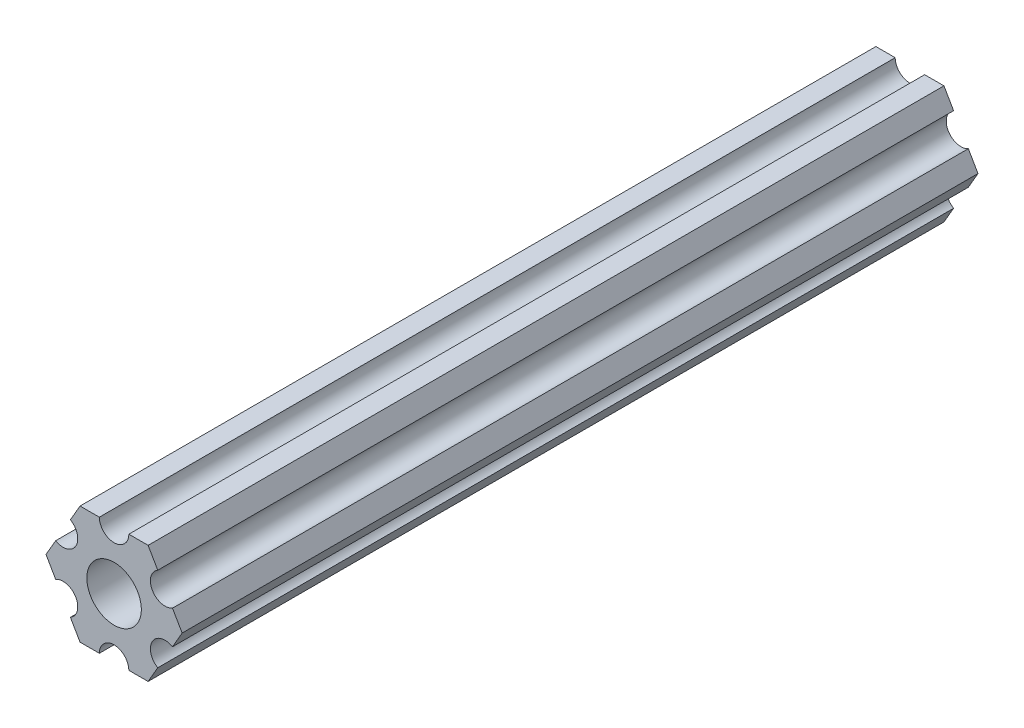
ISO-10303-21;
HEADER;
FILE_DESCRIPTION(('STEP AP214'),'2;1');
FILE_NAME('part.step','',(''),(''),'','','');
FILE_SCHEMA(('AUTOMOTIVE_DESIGN { 1 0 10303 214 1 1 1 1 }'));
ENDSEC;
DATA;
#1=APPLICATION_CONTEXT('core data for automotive mechanical design processes');
#2=APPLICATION_PROTOCOL_DEFINITION('international standard','automotive_design',2000,#1);
#3=PRODUCT_CONTEXT('',#1,'mechanical');
#4=PRODUCT('Part','Part','',(#3));
#5=PRODUCT_RELATED_PRODUCT_CATEGORY('part','',(#4));
#6=PRODUCT_DEFINITION_FORMATION('','',#4);
#7=PRODUCT_DEFINITION_CONTEXT('part definition',#1,'design');
#8=PRODUCT_DEFINITION('design','',#6,#7);
#9=PRODUCT_DEFINITION_SHAPE('','',#8);
#10=(LENGTH_UNIT() NAMED_UNIT(*) SI_UNIT(.MILLI.,.METRE.));
#11=(NAMED_UNIT(*) PLANE_ANGLE_UNIT() SI_UNIT($,.RADIAN.));
#12=(NAMED_UNIT(*) SI_UNIT($,.STERADIAN.) SOLID_ANGLE_UNIT());
#13=UNCERTAINTY_MEASURE_WITH_UNIT(LENGTH_MEASURE(1.E-05),#10,'distance_accuracy_value','');
#14=(GEOMETRIC_REPRESENTATION_CONTEXT(3) GLOBAL_UNCERTAINTY_ASSIGNED_CONTEXT((#13)) GLOBAL_UNIT_ASSIGNED_CONTEXT((#10,
#11,#12)) REPRESENTATION_CONTEXT('',''));
#15=CARTESIAN_POINT('',(0.,0.,0.));
#16=DIRECTION('',(0.,0.,1.));
#17=DIRECTION('',(1.,0.,0.));
#18=AXIS2_PLACEMENT_3D('',#15,#16,#17);
#19=CARTESIAN_POINT('',(6.29301142309098,-1.80018429024546,85.725));
#20=DIRECTION('',(-0.866025434075723,0.499999947533953,0.));
#21=DIRECTION('',(-0.499999947533953,-0.866025434075723,0.));
#22=AXIS2_PLACEMENT_3D('',#19,#20,#21);
#23=PLANE('',#22);
#24=DIRECTION('',(0.,0.,1.));
#25=VECTOR('',#24,1.);
#26=CARTESIAN_POINT('',(7.33234841870826,4.44212519169686E-07,85.725));
#27=LINE('',#26,#25);
#28=CARTESIAN_POINT('',(7.33234841870826,4.44212518961143E-07,0.));
#29=VERTEX_POINT('',#28);
#30=CARTESIAN_POINT('',(7.33234841870826,4.44212519315656E-07,85.725));
#31=VERTEX_POINT('',#30);
#32=EDGE_CURVE('E300',#29,#31,#27,.T.);
#33=ORIENTED_EDGE('',*,*,#32,.T.);
#34=DIRECTION('',(0.499999947533953,0.866025434075723,0.));
#35=VECTOR('',#34,1.);
#36=CARTESIAN_POINT('',(6.29301142309098,-1.80018429024546,85.725));
#37=LINE('',#36,#35);
#38=CARTESIAN_POINT('',(6.29301142309098,-1.80018429024546,85.725));
#39=VERTEX_POINT('',#38);
#40=EDGE_CURVE('E183',#39,#31,#37,.T.);
#41=ORIENTED_EDGE('',*,*,#40,.F.);
#42=DIRECTION('',(0.,0.,-1.));
#43=VECTOR('',#42,1.);
#44=CARTESIAN_POINT('',(6.29301142309098,-1.80018429024546,85.725));
#45=LINE('',#44,#43);
#46=CARTESIAN_POINT('',(6.29301142309098,-1.80018429024546,0.));
#47=VERTEX_POINT('',#46);
#48=EDGE_CURVE('E249',#39,#47,#45,.T.);
#49=ORIENTED_EDGE('',*,*,#48,.T.);
#50=DIRECTION('',(0.499999947533953,0.866025434075723,0.));
#51=VECTOR('',#50,1.);
#52=CARTESIAN_POINT('',(6.29301142309098,-1.80018429024546,0.));
#53=LINE('',#52,#51);
#54=EDGE_CURVE('E187',#47,#29,#53,.T.);
#55=ORIENTED_EDGE('',*,*,#54,.T.);
#56=EDGE_LOOP('',(#33,#41,#49,#55));
#57=FACE_BOUND('',#56,.T.);
#58=ADVANCED_FACE('F18',(#57),#23,.F.);
#59=CARTESIAN_POINT('',(7.33234841870826,4.44212519169686E-07,85.725));
#60=DIRECTION('',(-0.866025373493145,-0.500000052466056,0.));
#61=DIRECTION('',(0.500000052466056,-0.866025373493145,0.));
#62=AXIS2_PLACEMENT_3D('',#59,#60,#61);
#63=PLANE('',#62);
#64=DIRECTION('',(0.,0.,-1.));
#65=VECTOR('',#64,1.);
#66=CARTESIAN_POINT('',(6.29301120497139,1.80018505273895,85.725));
#67=LINE('',#66,#65);
#68=CARTESIAN_POINT('',(6.29301120497139,1.80018505273895,0.));
#69=VERTEX_POINT('',#68);
#70=CARTESIAN_POINT('',(6.29301120497139,1.80018505273895,85.725));
#71=VERTEX_POINT('',#70);
#72=EDGE_CURVE('E298',#69,#71,#67,.F.);
#73=ORIENTED_EDGE('',*,*,#72,.T.);
#74=DIRECTION('',(-0.500000052466056,0.866025373493145,0.));
#75=VECTOR('',#74,1.);
#76=CARTESIAN_POINT('',(7.33234841870826,4.44212519198905E-07,85.725));
#77=LINE('',#76,#75);
#78=EDGE_CURVE('E65',#31,#71,#77,.T.);
#79=ORIENTED_EDGE('',*,*,#78,.F.);
#80=ORIENTED_EDGE('',*,*,#32,.F.);
#81=DIRECTION('',(-0.500000052466056,0.866025373493145,0.));
#82=VECTOR('',#81,1.);
#83=CARTESIAN_POINT('',(7.33234841870826,4.44212519198905E-07,0.));
#84=LINE('',#83,#82);
#85=EDGE_CURVE('E246',#29,#69,#84,.T.);
#86=ORIENTED_EDGE('',*,*,#85,.T.);
#87=EDGE_LOOP('',(#73,#79,#80,#86));
#88=FACE_BOUND('',#87,.T.);
#89=ADVANCED_FACE('F347',(#88),#63,.F.);
#90=CARTESIAN_POINT('',(5.49926112168156,3.17500033315933,85.725));
#91=DIRECTION('',(0.,0.,-1.));
#92=DIRECTION('',(-1.,0.,0.));
#93=AXIS2_PLACEMENT_3D('',#90,#91,#92);
#94=CYLINDRICAL_SURFACE('',#93,1.5875);
#95=CARTESIAN_POINT('',(5.49926112168156,3.17500033315933,85.725));
#96=DIRECTION('',(0.,0.,-1.));
#97=DIRECTION('',(-1.,0.,0.));
#98=AXIS2_PLACEMENT_3D('',#95,#96,#97);
#99=CIRCLE('',#98,1.5875);
#100=CARTESIAN_POINT('',(4.70551103839172,4.54981561357972,85.725));
#101=VERTEX_POINT('',#100);
#102=EDGE_CURVE('E57',#71,#101,#99,.T.);
#103=ORIENTED_EDGE('',*,*,#102,.F.);
#104=ORIENTED_EDGE('',*,*,#72,.F.);
#105=CARTESIAN_POINT('',(5.49926112168156,3.17500033315933,0.));
#106=DIRECTION('',(0.,0.,-1.));
#107=DIRECTION('',(-1.,0.,0.));
#108=AXIS2_PLACEMENT_3D('',#105,#106,#107);
#109=CIRCLE('',#108,1.5875);
#110=CARTESIAN_POINT('',(4.70551103839172,4.54981561357972,0.));
#111=VERTEX_POINT('',#110);
#112=EDGE_CURVE('E21',#69,#111,#109,.T.);
#113=ORIENTED_EDGE('',*,*,#112,.T.);
#114=DIRECTION('',(0.,0.,1.));
#115=VECTOR('',#114,1.);
#116=CARTESIAN_POINT('',(4.70551103839172,4.54981561357972,85.725));
#117=LINE('',#116,#115);
#118=EDGE_CURVE('E294',#111,#101,#117,.T.);
#119=ORIENTED_EDGE('',*,*,#118,.T.);
#120=EDGE_LOOP('',(#103,#104,#113,#119));
#121=FACE_BOUND('',#120,.T.);
#122=ADVANCED_FACE('F345',(#121),#94,.F.);
#123=CARTESIAN_POINT('',(4.70551103839172,4.54981561357972,85.725));
#124=DIRECTION('',(-0.866025373493151,-0.500000052466046,0.));
#125=DIRECTION('',(0.500000052466046,-0.866025373493151,0.));
#126=AXIS2_PLACEMENT_3D('',#123,#124,#125);
#127=PLANE('',#126);
#128=DIRECTION('',(0.,0.,1.));
#129=VECTOR('',#128,1.);
#130=CARTESIAN_POINT('',(3.66617382465481,6.35000022210627,85.725));
#131=LINE('',#130,#129);
#132=CARTESIAN_POINT('',(3.66617382465481,6.35000022210627,0.));
#133=VERTEX_POINT('',#132);
#134=CARTESIAN_POINT('',(3.66617382465481,6.35000022210627,85.725));
#135=VERTEX_POINT('',#134);
#136=EDGE_CURVE('E291',#133,#135,#131,.T.);
#137=ORIENTED_EDGE('',*,*,#136,.T.);
#138=DIRECTION('',(-0.500000052466046,0.866025373493151,0.));
#139=VECTOR('',#138,1.);
#140=CARTESIAN_POINT('',(4.70551103839172,4.54981561357972,85.725));
#141=LINE('',#140,#139);
#142=EDGE_CURVE('E176',#101,#135,#141,.T.);
#143=ORIENTED_EDGE('',*,*,#142,.F.);
#144=ORIENTED_EDGE('',*,*,#118,.F.);
#145=DIRECTION('',(-0.500000052466046,0.866025373493151,0.));
#146=VECTOR('',#145,1.);
#147=CARTESIAN_POINT('',(4.70551103839172,4.54981561357972,0.));
#148=LINE('',#147,#146);
#149=EDGE_CURVE('E239',#111,#133,#148,.T.);
#150=ORIENTED_EDGE('',*,*,#149,.T.);
#151=EDGE_LOOP('',(#137,#143,#144,#150));
#152=FACE_BOUND('',#151,.T.);
#153=ADVANCED_FACE('F338',(#152),#127,.F.);
#154=CARTESIAN_POINT('',(3.66617382465481,6.35000022210627,85.725));
#155=DIRECTION('',(6.05825850611185E-08,-0.999999999999998,0.));
#156=DIRECTION('',(0.999999999999998,6.05825850611185E-08,0.));
#157=AXIS2_PLACEMENT_3D('',#154,#155,#156);
#158=PLANE('',#157);
#159=DIRECTION('',(0.,0.,-1.));
#160=VECTOR('',#159,1.);
#161=CARTESIAN_POINT('',(1.58749961530074,6.35000009617482,85.725));
#162=LINE('',#161,#160);
#163=CARTESIAN_POINT('',(1.58749961530073,6.35000015914054,0.));
#164=VERTEX_POINT('',#163);
#165=CARTESIAN_POINT('',(1.58749961530073,6.35000015914054,85.725));
#166=VERTEX_POINT('',#165);
#167=EDGE_CURVE('E289',#164,#166,#162,.F.);
#168=ORIENTED_EDGE('',*,*,#167,.T.);
#169=DIRECTION('',(1.,0.,0.));
#170=VECTOR('',#169,1.);
#171=CARTESIAN_POINT('',(5.49926112168156,6.35000022210627,85.725));
#172=LINE('',#171,#170);
#173=EDGE_CURVE('E146',#135,#166,#172,.F.);
#174=ORIENTED_EDGE('',*,*,#173,.F.);
#175=ORIENTED_EDGE('',*,*,#136,.F.);
#176=DIRECTION('',(1.,0.,0.));
#177=VECTOR('',#176,1.);
#178=CARTESIAN_POINT('',(5.49926112168156,6.35000022210627,0.));
#179=LINE('',#178,#177);
#180=EDGE_CURVE('E236',#133,#164,#179,.F.);
#181=ORIENTED_EDGE('',*,*,#180,.T.);
#182=EDGE_LOOP('',(#168,#174,#175,#181));
#183=FACE_BOUND('',#182,.T.);
#184=ADVANCED_FACE('F335',(#183),#158,.F.);
#185=CARTESIAN_POINT('',(-3.84699260060323E-07,6.35,85.725));
#186=DIRECTION('',(0.,0.,-1.));
#187=DIRECTION('',(-1.,0.,0.));
#188=AXIS2_PLACEMENT_3D('',#185,#186,#187);
#189=CYLINDRICAL_SURFACE('',#188,1.5875);
#190=DIRECTION('',(0.,0.,1.));
#191=VECTOR('',#190,1.);
#192=CARTESIAN_POINT('',(-1.58750038469926,6.34999990382518,85.725));
#193=LINE('',#192,#191);
#194=CARTESIAN_POINT('',(-1.58750038469926,6.34999990382518,0.));
#195=VERTEX_POINT('',#194);
#196=CARTESIAN_POINT('',(-1.58750038469926,6.34999990382518,85.725));
#197=VERTEX_POINT('',#196);
#198=EDGE_CURVE('E105',#195,#197,#193,.T.);
#199=ORIENTED_EDGE('',*,*,#198,.T.);
#200=CARTESIAN_POINT('',(-3.84699260060323E-07,6.35,85.725));
#201=DIRECTION('',(0.,0.,-1.));
#202=DIRECTION('',(-1.,0.,0.));
#203=AXIS2_PLACEMENT_3D('',#200,#201,#202);
#204=CIRCLE('',#203,1.5875);
#205=EDGE_CURVE('E150',#166,#197,#204,.T.);
#206=ORIENTED_EDGE('',*,*,#205,.F.);
#207=ORIENTED_EDGE('',*,*,#167,.F.);
#208=CARTESIAN_POINT('',(-3.84699260060323E-07,6.35,0.));
#209=DIRECTION('',(0.,0.,-1.));
#210=DIRECTION('',(-1.,0.,0.));
#211=AXIS2_PLACEMENT_3D('',#208,#209,#210);
#212=CIRCLE('',#211,1.5875);
#213=EDGE_CURVE('E233',#164,#195,#212,.T.);
#214=ORIENTED_EDGE('',*,*,#213,.T.);
#215=EDGE_LOOP('',(#199,#206,#207,#214));
#216=FACE_BOUND('',#215,.T.);
#217=ADVANCED_FACE('F329',(#216),#189,.F.);
#218=CARTESIAN_POINT('',(-1.58750038469926,6.34999990382518,85.725));
#219=DIRECTION('',(6.05825963273174E-08,-0.999999999999998,0.));
#220=DIRECTION('',(0.999999999999998,6.05825963273174E-08,0.));
#221=AXIS2_PLACEMENT_3D('',#218,#219,#220);
#222=PLANE('',#221);
#223=DIRECTION('',(0.,0.,1.));
#224=VECTOR('',#223,1.);
#225=CARTESIAN_POINT('',(-3.66617459405349,6.3499997778937,85.725));
#226=LINE('',#225,#224);
#227=CARTESIAN_POINT('',(-3.66617454558244,6.34999986184803,0.));
#228=VERTEX_POINT('',#227);
#229=CARTESIAN_POINT('',(-3.66617454558244,6.34999986184803,85.725));
#230=VERTEX_POINT('',#229);
#231=EDGE_CURVE('E113',#228,#230,#226,.T.);
#232=ORIENTED_EDGE('',*,*,#231,.T.);
#233=DIRECTION('',(1.,0.,0.));
#234=VECTOR('',#233,1.);
#235=CARTESIAN_POINT('',(5.49926112168156,6.34999990382518,85.725));
#236=LINE('',#235,#234);
#237=EDGE_CURVE('E151',#197,#230,#236,.F.);
#238=ORIENTED_EDGE('',*,*,#237,.F.);
#239=ORIENTED_EDGE('',*,*,#198,.F.);
#240=DIRECTION('',(1.,0.,0.));
#241=VECTOR('',#240,1.);
#242=CARTESIAN_POINT('',(5.49926112168156,6.34999990382518,0.));
#243=LINE('',#242,#241);
#244=EDGE_CURVE('E158',#195,#228,#243,.F.);
#245=ORIENTED_EDGE('',*,*,#244,.T.);
#246=EDGE_LOOP('',(#232,#238,#239,#245));
#247=FACE_BOUND('',#246,.T.);
#248=ADVANCED_FACE('F157',(#247),#222,.F.);
#249=CARTESIAN_POINT('',(-3.66617459405349,6.3499997778937,85.725));
#250=DIRECTION('',(0.866025434075729,-0.499999947533942,0.));
#251=DIRECTION('',(0.499999947533942,0.866025434075729,0.));
#252=AXIS2_PLACEMENT_3D('',#249,#250,#251);
#253=PLANE('',#252);
#254=DIRECTION('',(0.,0.,-1.));
#255=VECTOR('',#254,1.);
#256=CARTESIAN_POINT('',(-4.70551158967065,4.54981504343587,85.725));
#257=LINE('',#256,#255);
#258=CARTESIAN_POINT('',(-4.70551158967065,4.54981504343587,0.));
#259=VERTEX_POINT('',#258);
#260=CARTESIAN_POINT('',(-4.70551158967065,4.54981504343587,85.725));
#261=VERTEX_POINT('',#260);
#262=EDGE_CURVE('E159',#259,#261,#257,.F.);
#263=ORIENTED_EDGE('',*,*,#262,.T.);
#264=DIRECTION('',(-0.499999947533943,-0.866025434075729,0.));
#265=VECTOR('',#264,1.);
#266=CARTESIAN_POINT('',(-3.66617459405349,6.3499997778937,85.725));
#267=LINE('',#266,#265);
#268=EDGE_CURVE('E154',#230,#261,#267,.T.);
#269=ORIENTED_EDGE('',*,*,#268,.F.);
#270=ORIENTED_EDGE('',*,*,#231,.F.);
#271=DIRECTION('',(-0.499999947533943,-0.866025434075729,0.));
#272=VECTOR('',#271,1.);
#273=CARTESIAN_POINT('',(-3.66617459405349,6.3499997778937,0.));
#274=LINE('',#273,#272);
#275=EDGE_CURVE('E228',#228,#259,#274,.T.);
#276=ORIENTED_EDGE('',*,*,#275,.T.);
#277=EDGE_LOOP('',(#263,#269,#270,#276));
#278=FACE_BOUND('',#277,.T.);
#279=ADVANCED_FACE('F161',(#278),#253,.F.);
#280=CARTESIAN_POINT('',(-5.49926150638082,3.17499966684067,85.725));
#281=DIRECTION('',(0.,0.,-1.));
#282=DIRECTION('',(-1.,0.,0.));
#283=AXIS2_PLACEMENT_3D('',#280,#281,#282);
#284=CYLINDRICAL_SURFACE('',#283,1.5875);
#285=DIRECTION('',(0.,0.,1.));
#286=VECTOR('',#285,1.);
#287=CARTESIAN_POINT('',(-6.29301142309098,1.80018429024547,85.725));
#288=LINE('',#287,#286);
#289=CARTESIAN_POINT('',(-6.29301142309098,1.80018429024547,0.));
#290=VERTEX_POINT('',#289);
#291=CARTESIAN_POINT('',(-6.29301142309098,1.80018429024547,85.725));
#292=VERTEX_POINT('',#291);
#293=EDGE_CURVE('E280',#290,#292,#288,.T.);
#294=ORIENTED_EDGE('',*,*,#293,.T.);
#295=CARTESIAN_POINT('',(-5.49926150638082,3.17499966684067,85.725));
#296=DIRECTION('',(0.,0.,-1.));
#297=DIRECTION('',(-1.,0.,0.));
#298=AXIS2_PLACEMENT_3D('',#295,#296,#297);
#299=CIRCLE('',#298,1.5875);
#300=EDGE_CURVE('E163',#261,#292,#299,.T.);
#301=ORIENTED_EDGE('',*,*,#300,.F.);
#302=ORIENTED_EDGE('',*,*,#262,.F.);
#303=CARTESIAN_POINT('',(-5.49926150638082,3.17499966684067,0.));
#304=DIRECTION('',(0.,0.,-1.));
#305=DIRECTION('',(-1.,0.,0.));
#306=AXIS2_PLACEMENT_3D('',#303,#304,#305);
#307=CIRCLE('',#306,1.5875);
#308=EDGE_CURVE('E225',#259,#290,#307,.T.);
#309=ORIENTED_EDGE('',*,*,#308,.T.);
#310=EDGE_LOOP('',(#294,#301,#302,#309));
#311=FACE_BOUND('',#310,.T.);
#312=ADVANCED_FACE('F410',(#311),#284,.F.);
#313=CARTESIAN_POINT('',(-6.29301142309098,1.80018429024547,85.725));
#314=DIRECTION('',(0.866025434075724,-0.499999947533951,0.));
#315=DIRECTION('',(0.499999947533951,0.866025434075724,0.));
#316=AXIS2_PLACEMENT_3D('',#313,#314,#315);
#317=PLANE('',#316);
#318=DIRECTION('',(0.,0.,1.));
#319=VECTOR('',#318,1.);
#320=CARTESIAN_POINT('',(-7.33234841870826,-4.44212523790841E-07,85.725));
#321=LINE('',#320,#319);
#322=CARTESIAN_POINT('',(-7.33234841870826,-4.44212524036367E-07,0.));
#323=VERTEX_POINT('',#322);
#324=CARTESIAN_POINT('',(-7.33234841870826,-4.44212524036367E-07,85.725));
#325=VERTEX_POINT('',#324);
#326=EDGE_CURVE('E277',#323,#325,#321,.T.);
#327=ORIENTED_EDGE('',*,*,#326,.T.);
#328=DIRECTION('',(-0.499999947533952,-0.866025434075724,0.));
#329=VECTOR('',#328,1.);
#330=CARTESIAN_POINT('',(-6.29301142309098,1.80018429024547,85.725));
#331=LINE('',#330,#329);
#332=EDGE_CURVE('E165',#292,#325,#331,.T.);
#333=ORIENTED_EDGE('',*,*,#332,.F.);
#334=ORIENTED_EDGE('',*,*,#293,.F.);
#335=DIRECTION('',(-0.499999947533952,-0.866025434075724,0.));
#336=VECTOR('',#335,1.);
#337=CARTESIAN_POINT('',(-6.29301142309098,1.80018429024547,0.));
#338=LINE('',#337,#336);
#339=EDGE_CURVE('E220',#290,#323,#338,.T.);
#340=ORIENTED_EDGE('',*,*,#339,.T.);
#341=EDGE_LOOP('',(#327,#333,#334,#340));
#342=FACE_BOUND('',#341,.T.);
#343=ADVANCED_FACE('F378',(#342),#317,.F.);
#344=CARTESIAN_POINT('',(-7.33234841870826,-4.44212523790841E-07,85.725));
#345=DIRECTION('',(0.866025373493151,0.500000052466045,0.));
#346=DIRECTION('',(-0.500000052466045,0.866025373493151,0.));
#347=AXIS2_PLACEMENT_3D('',#344,#345,#346);
#348=PLANE('',#347);
#349=DIRECTION('',(0.,0.,-1.));
#350=VECTOR('',#349,1.);
#351=CARTESIAN_POINT('',(-6.29301120497141,-1.80018505273896,85.725));
#352=LINE('',#351,#350);
#353=CARTESIAN_POINT('',(-6.29301120497141,-1.80018505273896,0.));
#354=VERTEX_POINT('',#353);
#355=CARTESIAN_POINT('',(-6.29301120497141,-1.80018505273896,85.725));
#356=VERTEX_POINT('',#355);
#357=EDGE_CURVE('E274',#354,#356,#352,.F.);
#358=ORIENTED_EDGE('',*,*,#357,.T.);
#359=DIRECTION('',(0.500000052466045,-0.866025373493151,0.));
#360=VECTOR('',#359,1.);
#361=CARTESIAN_POINT('',(-7.33234841870826,-4.44212523969395E-07,85.725));
#362=LINE('',#361,#360);
#363=EDGE_CURVE('E315',#325,#356,#362,.T.);
#364=ORIENTED_EDGE('',*,*,#363,.F.);
#365=ORIENTED_EDGE('',*,*,#326,.F.);
#366=DIRECTION('',(0.500000052466045,-0.866025373493151,0.));
#367=VECTOR('',#366,1.);
#368=CARTESIAN_POINT('',(-7.33234841870826,-4.44212523969395E-07,0.));
#369=LINE('',#368,#367);
#370=EDGE_CURVE('E217',#323,#354,#369,.T.);
#371=ORIENTED_EDGE('',*,*,#370,.T.);
#372=EDGE_LOOP('',(#358,#364,#365,#371));
#373=FACE_BOUND('',#372,.T.);
#374=ADVANCED_FACE('F382',(#373),#348,.F.);
#375=CARTESIAN_POINT('',(-5.49926112168156,-3.17500033315934,85.725));
#376=DIRECTION('',(0.,0.,-1.));
#377=DIRECTION('',(-1.,0.,0.));
#378=AXIS2_PLACEMENT_3D('',#375,#376,#377);
#379=CYLINDRICAL_SURFACE('',#378,1.5875);
#380=DIRECTION('',(0.,0.,1.));
#381=VECTOR('',#380,1.);
#382=CARTESIAN_POINT('',(-4.70551103839172,-4.54981561357972,85.725));
#383=LINE('',#382,#381);
#384=CARTESIAN_POINT('',(-4.70551103839172,-4.54981561357972,0.));
#385=VERTEX_POINT('',#384);
#386=CARTESIAN_POINT('',(-4.70551103839172,-4.54981561357972,85.725));
#387=VERTEX_POINT('',#386);
#388=EDGE_CURVE('E269',#385,#387,#383,.T.);
#389=ORIENTED_EDGE('',*,*,#388,.T.);
#390=CARTESIAN_POINT('',(-5.49926112168156,-3.17500033315934,85.725));
#391=DIRECTION('',(0.,0.,-1.));
#392=DIRECTION('',(-1.,0.,0.));
#393=AXIS2_PLACEMENT_3D('',#390,#391,#392);
#394=CIRCLE('',#393,1.5875);
#395=EDGE_CURVE('E313',#356,#387,#394,.T.);
#396=ORIENTED_EDGE('',*,*,#395,.F.);
#397=ORIENTED_EDGE('',*,*,#357,.F.);
#398=CARTESIAN_POINT('',(-5.49926112168156,-3.17500033315934,0.));
#399=DIRECTION('',(0.,0.,-1.));
#400=DIRECTION('',(-1.,0.,0.));
#401=AXIS2_PLACEMENT_3D('',#398,#399,#400);
#402=CIRCLE('',#401,1.5875);
#403=EDGE_CURVE('E214',#354,#385,#402,.T.);
#404=ORIENTED_EDGE('',*,*,#403,.T.);
#405=EDGE_LOOP('',(#389,#396,#397,#404));
#406=FACE_BOUND('',#405,.T.);
#407=ADVANCED_FACE('F386',(#406),#379,.F.);
#408=CARTESIAN_POINT('',(-4.70551103839172,-4.54981561357972,85.725));
#409=DIRECTION('',(0.866025373493151,0.500000052466045,0.));
#410=DIRECTION('',(-0.500000052466045,0.866025373493151,0.));
#411=AXIS2_PLACEMENT_3D('',#408,#409,#410);
#412=PLANE('',#411);
#413=DIRECTION('',(0.,0.,1.));
#414=VECTOR('',#413,1.);
#415=CARTESIAN_POINT('',(-3.66617382465481,-6.35000022210628,85.725));
#416=LINE('',#415,#414);
#417=CARTESIAN_POINT('',(-3.6661738246548,-6.35000022210628,0.));
#418=VERTEX_POINT('',#417);
#419=CARTESIAN_POINT('',(-3.6661738246548,-6.35000022210628,85.725));
#420=VERTEX_POINT('',#419);
#421=EDGE_CURVE('E266',#418,#420,#416,.T.);
#422=ORIENTED_EDGE('',*,*,#421,.T.);
#423=DIRECTION('',(0.500000052466045,-0.866025373493151,0.));
#424=VECTOR('',#423,1.);
#425=CARTESIAN_POINT('',(-4.70551103839172,-4.54981561357972,85.725));
#426=LINE('',#425,#424);
#427=EDGE_CURVE('E314',#387,#420,#426,.T.);
#428=ORIENTED_EDGE('',*,*,#427,.F.);
#429=ORIENTED_EDGE('',*,*,#388,.F.);
#430=DIRECTION('',(0.500000052466045,-0.866025373493151,0.));
#431=VECTOR('',#430,1.);
#432=CARTESIAN_POINT('',(-4.70551103839172,-4.54981561357972,0.));
#433=LINE('',#432,#431);
#434=EDGE_CURVE('E209',#385,#418,#433,.T.);
#435=ORIENTED_EDGE('',*,*,#434,.T.);
#436=EDGE_LOOP('',(#422,#428,#429,#435));
#437=FACE_BOUND('',#436,.T.);
#438=ADVANCED_FACE('F392',(#437),#412,.F.);
#439=CARTESIAN_POINT('',(-3.66617382465481,-6.35000022210628,85.725));
#440=DIRECTION('',(-6.05825854783851E-08,0.999999999999998,0.));
#441=DIRECTION('',(-0.999999999999998,-6.05825854783851E-08,0.));
#442=AXIS2_PLACEMENT_3D('',#439,#440,#441);
#443=PLANE('',#442);
#444=DIRECTION('',(0.,0.,-1.));
#445=VECTOR('',#444,1.);
#446=CARTESIAN_POINT('',(-1.58749961530074,-6.35,85.725));
#447=LINE('',#446,#445);
#448=CARTESIAN_POINT('',(-1.58749961530073,-6.35000011105314,0.));
#449=VERTEX_POINT('',#448);
#450=CARTESIAN_POINT('',(-1.58749961530073,-6.35000011105314,85.725));
#451=VERTEX_POINT('',#450);
#452=EDGE_CURVE('E263',#449,#451,#447,.F.);
#453=ORIENTED_EDGE('',*,*,#452,.T.);
#454=DIRECTION('',(1.,0.,0.));
#455=VECTOR('',#454,1.);
#456=CARTESIAN_POINT('',(5.49926112168156,-6.35000022210628,85.725));
#457=LINE('',#456,#455);
#458=EDGE_CURVE('E312',#420,#451,#457,.T.);
#459=ORIENTED_EDGE('',*,*,#458,.F.);
#460=ORIENTED_EDGE('',*,*,#421,.F.);
#461=DIRECTION('',(1.,0.,0.));
#462=VECTOR('',#461,1.);
#463=CARTESIAN_POINT('',(5.49926112168156,-6.35000022210628,0.));
#464=LINE('',#463,#462);
#465=EDGE_CURVE('E206',#418,#449,#464,.T.);
#466=ORIENTED_EDGE('',*,*,#465,.T.);
#467=EDGE_LOOP('',(#453,#459,#460,#466));
#468=FACE_BOUND('',#467,.T.);
#469=ADVANCED_FACE('F396',(#468),#443,.F.);
#470=CARTESIAN_POINT('',(3.8469926204343E-07,-6.35,85.725));
#471=DIRECTION('',(0.,0.,-1.));
#472=DIRECTION('',(-1.,0.,0.));
#473=AXIS2_PLACEMENT_3D('',#470,#471,#472);
#474=CYLINDRICAL_SURFACE('',#473,1.5875);
#475=DIRECTION('',(0.,0.,1.));
#476=VECTOR('',#475,1.);
#477=CARTESIAN_POINT('',(1.58750038469926,-6.34999990382518,85.725));
#478=LINE('',#477,#476);
#479=CARTESIAN_POINT('',(1.58750038469926,-6.34999990382518,0.));
#480=VERTEX_POINT('',#479);
#481=CARTESIAN_POINT('',(1.58750038469926,-6.34999990382518,85.725));
#482=VERTEX_POINT('',#481);
#483=EDGE_CURVE('E258',#480,#482,#478,.T.);
#484=ORIENTED_EDGE('',*,*,#483,.T.);
#485=CARTESIAN_POINT('',(3.8469926204343E-07,-6.35,85.725));
#486=DIRECTION('',(0.,0.,-1.));
#487=DIRECTION('',(-1.,0.,0.));
#488=AXIS2_PLACEMENT_3D('',#485,#486,#487);
#489=CIRCLE('',#488,1.5875);
#490=EDGE_CURVE('E309',#451,#482,#489,.T.);
#491=ORIENTED_EDGE('',*,*,#490,.F.);
#492=ORIENTED_EDGE('',*,*,#452,.F.);
#493=CARTESIAN_POINT('',(3.8469926204343E-07,-6.35,0.));
#494=DIRECTION('',(0.,0.,-1.));
#495=DIRECTION('',(-1.,0.,0.));
#496=AXIS2_PLACEMENT_3D('',#493,#494,#495);
#497=CIRCLE('',#496,1.5875);
#498=EDGE_CURVE('E203',#449,#480,#497,.T.);
#499=ORIENTED_EDGE('',*,*,#498,.T.);
#500=EDGE_LOOP('',(#484,#491,#492,#499));
#501=FACE_BOUND('',#500,.T.);
#502=ADVANCED_FACE('F400',(#501),#474,.F.);
#503=CARTESIAN_POINT('',(1.58750038469926,-6.34999990382518,85.725));
#504=DIRECTION('',(-6.05825721258438E-08,0.999999999999998,0.));
#505=DIRECTION('',(-0.999999999999998,-6.05825721258438E-08,0.));
#506=AXIS2_PLACEMENT_3D('',#503,#504,#505);
#507=PLANE('',#506);
#508=DIRECTION('',(0.,0.,1.));
#509=VECTOR('',#508,1.);
#510=CARTESIAN_POINT('',(3.66617459405346,-6.34999977789375,85.725));
#511=LINE('',#510,#509);
#512=CARTESIAN_POINT('',(3.66617454558244,-6.34999986184804,0.));
#513=VERTEX_POINT('',#512);
#514=CARTESIAN_POINT('',(3.66617454558244,-6.34999986184804,85.725));
#515=VERTEX_POINT('',#514);
#516=EDGE_CURVE('E255',#513,#515,#511,.T.);
#517=ORIENTED_EDGE('',*,*,#516,.T.);
#518=DIRECTION('',(1.,0.,0.));
#519=VECTOR('',#518,1.);
#520=CARTESIAN_POINT('',(5.49926112168156,-6.34999990382518,85.725));
#521=LINE('',#520,#519);
#522=EDGE_CURVE('E311',#482,#515,#521,.T.);
#523=ORIENTED_EDGE('',*,*,#522,.F.);
#524=ORIENTED_EDGE('',*,*,#483,.F.);
#525=DIRECTION('',(1.,0.,0.));
#526=VECTOR('',#525,1.);
#527=CARTESIAN_POINT('',(5.49926112168156,-6.34999990382518,0.));
#528=LINE('',#527,#526);
#529=EDGE_CURVE('E198',#480,#513,#528,.T.);
#530=ORIENTED_EDGE('',*,*,#529,.T.);
#531=EDGE_LOOP('',(#517,#523,#524,#530));
#532=FACE_BOUND('',#531,.T.);
#533=ADVANCED_FACE('F403',(#532),#507,.F.);
#534=CARTESIAN_POINT('',(3.66617459405346,-6.34999977789375,85.725));
#535=DIRECTION('',(-0.86602543407573,0.499999947533941,0.));
#536=DIRECTION('',(-0.499999947533941,-0.86602543407573,0.));
#537=AXIS2_PLACEMENT_3D('',#534,#535,#536);
#538=PLANE('',#537);
#539=DIRECTION('',(0.,0.,1.));
#540=VECTOR('',#539,1.);
#541=CARTESIAN_POINT('',(4.70551158967065,-4.54981504343587,85.725));
#542=LINE('',#541,#540);
#543=CARTESIAN_POINT('',(4.70551158967065,-4.54981504343587,85.725));
#544=VERTEX_POINT('',#543);
#545=CARTESIAN_POINT('',(4.70551158967065,-4.54981504343587,0.));
#546=VERTEX_POINT('',#545);
#547=EDGE_CURVE('E253',#544,#546,#542,.F.);
#548=ORIENTED_EDGE('',*,*,#547,.F.);
#549=DIRECTION('',(0.49999994753394,0.86602543407573,0.));
#550=VECTOR('',#549,1.);
#551=CARTESIAN_POINT('',(3.66617459405346,-6.34999977789376,85.725));
#552=LINE('',#551,#550);
#553=EDGE_CURVE('E308',#515,#544,#552,.T.);
#554=ORIENTED_EDGE('',*,*,#553,.F.);
#555=ORIENTED_EDGE('',*,*,#516,.F.);
#556=DIRECTION('',(0.49999994753394,0.86602543407573,0.));
#557=VECTOR('',#556,1.);
#558=CARTESIAN_POINT('',(3.66617459405346,-6.34999977789376,0.));
#559=LINE('',#558,#557);
#560=EDGE_CURVE('E195',#513,#546,#559,.T.);
#561=ORIENTED_EDGE('',*,*,#560,.T.);
#562=EDGE_LOOP('',(#548,#554,#555,#561));
#563=FACE_BOUND('',#562,.T.);
#564=ADVANCED_FACE('F405',(#563),#538,.F.);
#565=CARTESIAN_POINT('',(5.49926150638082,-3.17499966684067,85.725));
#566=DIRECTION('',(0.,0.,-1.));
#567=DIRECTION('',(-1.,0.,0.));
#568=AXIS2_PLACEMENT_3D('',#565,#566,#567);
#569=CYLINDRICAL_SURFACE('',#568,1.58750000000001);
#570=CARTESIAN_POINT('',(5.49926150638082,-3.17499966684067,85.725));
#571=DIRECTION('',(0.,0.,-1.));
#572=DIRECTION('',(-1.,0.,0.));
#573=AXIS2_PLACEMENT_3D('',#570,#571,#572);
#574=CIRCLE('',#573,1.58750000000001);
#575=EDGE_CURVE('E36',#544,#39,#574,.T.);
#576=ORIENTED_EDGE('',*,*,#575,.F.);
#577=ORIENTED_EDGE('',*,*,#547,.T.);
#578=CARTESIAN_POINT('',(5.49926150638082,-3.17499966684067,0.));
#579=DIRECTION('',(0.,0.,-1.));
#580=DIRECTION('',(-1.,0.,0.));
#581=AXIS2_PLACEMENT_3D('',#578,#579,#580);
#582=CIRCLE('',#581,1.58750000000001);
#583=EDGE_CURVE('E192',#546,#47,#582,.T.);
#584=ORIENTED_EDGE('',*,*,#583,.T.);
#585=ORIENTED_EDGE('',*,*,#48,.F.);
#586=EDGE_LOOP('',(#576,#577,#584,#585));
#587=FACE_BOUND('',#586,.T.);
#588=ADVANCED_FACE('F351',(#587),#569,.F.);
#589=CARTESIAN_POINT('',(5.49926112168156,3.17500033315933,0.));
#590=DIRECTION('',(0.,0.,1.));
#591=DIRECTION('',(1.,0.,0.));
#592=AXIS2_PLACEMENT_3D('',#589,#590,#591);
#593=PLANE('',#592);
#594=CARTESIAN_POINT('',(0.,0.,0.));
#595=DIRECTION('',(0.,0.,-1.));
#596=DIRECTION('',(-1.,0.,0.));
#597=AXIS2_PLACEMENT_3D('',#594,#595,#596);
#598=CIRCLE('',#597,2.9337);
#599=CARTESIAN_POINT('',(-2.9337,0.,0.));
#600=VERTEX_POINT('',#599);
#601=EDGE_CURVE('E27',#600,#600,#598,.F.);
#602=ORIENTED_EDGE('',*,*,#601,.T.);
#603=EDGE_LOOP('',(#602));
#604=FACE_BOUND('',#603,.T.);
#605=ORIENTED_EDGE('',*,*,#583,.F.);
#606=ORIENTED_EDGE('',*,*,#560,.F.);
#607=ORIENTED_EDGE('',*,*,#529,.F.);
#608=ORIENTED_EDGE('',*,*,#498,.F.);
#609=ORIENTED_EDGE('',*,*,#465,.F.);
#610=ORIENTED_EDGE('',*,*,#434,.F.);
#611=ORIENTED_EDGE('',*,*,#403,.F.);
#612=ORIENTED_EDGE('',*,*,#370,.F.);
#613=ORIENTED_EDGE('',*,*,#339,.F.);
#614=ORIENTED_EDGE('',*,*,#308,.F.);
#615=ORIENTED_EDGE('',*,*,#275,.F.);
#616=ORIENTED_EDGE('',*,*,#244,.F.);
#617=ORIENTED_EDGE('',*,*,#213,.F.);
#618=ORIENTED_EDGE('',*,*,#180,.F.);
#619=ORIENTED_EDGE('',*,*,#149,.F.);
#620=ORIENTED_EDGE('',*,*,#112,.F.);
#621=ORIENTED_EDGE('',*,*,#85,.F.);
#622=ORIENTED_EDGE('',*,*,#54,.F.);
#623=EDGE_LOOP('',(#605,#606,#607,#608,#609,#610,#611,#612,#613,#614,#615,#616,#617,#618,#619,
#620,#621,#622));
#624=FACE_BOUND('',#623,.T.);
#625=ADVANCED_FACE('F332',(#604,#624),#593,.F.);
#626=CARTESIAN_POINT('',(5.49926112168156,3.17500033315933,85.725));
#627=DIRECTION('',(0.,0.,1.));
#628=DIRECTION('',(1.,0.,0.));
#629=AXIS2_PLACEMENT_3D('',#626,#627,#628);
#630=PLANE('',#629);
#631=CARTESIAN_POINT('',(0.,0.,85.725));
#632=DIRECTION('',(0.,0.,-1.));
#633=DIRECTION('',(-1.,0.,0.));
#634=AXIS2_PLACEMENT_3D('',#631,#632,#633);
#635=CIRCLE('',#634,2.9337);
#636=CARTESIAN_POINT('',(-2.9337,0.,85.725));
#637=VERTEX_POINT('',#636);
#638=EDGE_CURVE('E11',#637,#637,#635,.T.);
#639=ORIENTED_EDGE('',*,*,#638,.T.);
#640=EDGE_LOOP('',(#639));
#641=FACE_BOUND('',#640,.T.);
#642=ORIENTED_EDGE('',*,*,#553,.T.);
#643=ORIENTED_EDGE('',*,*,#575,.T.);
#644=ORIENTED_EDGE('',*,*,#40,.T.);
#645=ORIENTED_EDGE('',*,*,#78,.T.);
#646=ORIENTED_EDGE('',*,*,#102,.T.);
#647=ORIENTED_EDGE('',*,*,#142,.T.);
#648=ORIENTED_EDGE('',*,*,#173,.T.);
#649=ORIENTED_EDGE('',*,*,#205,.T.);
#650=ORIENTED_EDGE('',*,*,#237,.T.);
#651=ORIENTED_EDGE('',*,*,#268,.T.);
#652=ORIENTED_EDGE('',*,*,#300,.T.);
#653=ORIENTED_EDGE('',*,*,#332,.T.);
#654=ORIENTED_EDGE('',*,*,#363,.T.);
#655=ORIENTED_EDGE('',*,*,#395,.T.);
#656=ORIENTED_EDGE('',*,*,#427,.T.);
#657=ORIENTED_EDGE('',*,*,#458,.T.);
#658=ORIENTED_EDGE('',*,*,#490,.T.);
#659=ORIENTED_EDGE('',*,*,#522,.T.);
#660=EDGE_LOOP('',(#642,#643,#644,#645,#646,#647,#648,#649,#650,#651,#652,#653,#654,#655,#656,
#657,#658,#659));
#661=FACE_BOUND('',#660,.T.);
#662=ADVANCED_FACE('F153',(#641,#661),#630,.T.);
#663=CARTESIAN_POINT('',(0.,0.,85.725));
#664=DIRECTION('',(0.,0.,-1.));
#665=DIRECTION('',(-1.,0.,0.));
#666=AXIS2_PLACEMENT_3D('',#663,#664,#665);
#667=CYLINDRICAL_SURFACE('',#666,2.9337);
#668=ORIENTED_EDGE('',*,*,#601,.F.);
#669=EDGE_LOOP('',(#668));
#670=FACE_BOUND('',#669,.T.);
#671=ORIENTED_EDGE('',*,*,#638,.F.);
#672=EDGE_LOOP('',(#671));
#673=FACE_BOUND('',#672,.T.);
#674=ADVANCED_FACE('F420',(#670,#673),#667,.F.);
#675=CLOSED_SHELL('',(#58,#89,#122,#153,#184,#217,#248,#279,#312,#343,#374,#407,#438,#469,#502,
#533,#564,#588,#625,#662,#674));
#676=MANIFOLD_SOLID_BREP('B1',#675);
#677=ADVANCED_BREP_SHAPE_REPRESENTATION('',(#18,#676),#14);
#678=SHAPE_DEFINITION_REPRESENTATION(#9,#677);
ENDSEC;
END-ISO-10303-21;
